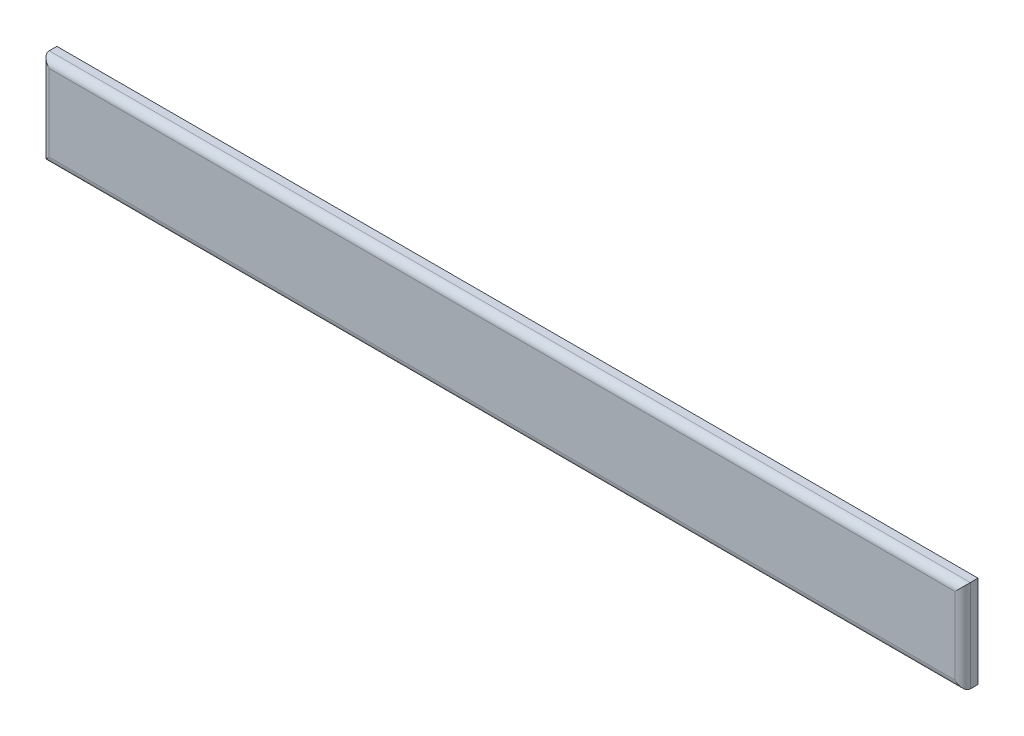
ISO-10303-21;
HEADER;
FILE_DESCRIPTION(('STEP AP214'),'2;1');
FILE_NAME('part.step','',(''),(''),'','','');
FILE_SCHEMA(('AUTOMOTIVE_DESIGN { 1 0 10303 214 1 1 1 1 }'));
ENDSEC;
DATA;
#1=APPLICATION_CONTEXT('core data for automotive mechanical design processes');
#2=APPLICATION_PROTOCOL_DEFINITION('international standard','automotive_design',2000,#1);
#3=PRODUCT_CONTEXT('',#1,'mechanical');
#4=PRODUCT('Part','Part','',(#3));
#5=PRODUCT_RELATED_PRODUCT_CATEGORY('part','',(#4));
#6=PRODUCT_DEFINITION_FORMATION('','',#4);
#7=PRODUCT_DEFINITION_CONTEXT('part definition',#1,'design');
#8=PRODUCT_DEFINITION('design','',#6,#7);
#9=PRODUCT_DEFINITION_SHAPE('','',#8);
#10=(LENGTH_UNIT() NAMED_UNIT(*) SI_UNIT(.MILLI.,.METRE.));
#11=(NAMED_UNIT(*) PLANE_ANGLE_UNIT() SI_UNIT($,.RADIAN.));
#12=(NAMED_UNIT(*) SI_UNIT($,.STERADIAN.) SOLID_ANGLE_UNIT());
#13=UNCERTAINTY_MEASURE_WITH_UNIT(LENGTH_MEASURE(1.E-05),#10,'distance_accuracy_value','');
#14=(GEOMETRIC_REPRESENTATION_CONTEXT(3) GLOBAL_UNCERTAINTY_ASSIGNED_CONTEXT((#13)) GLOBAL_UNIT_ASSIGNED_CONTEXT((#10,
#11,#12)) REPRESENTATION_CONTEXT('',''));
#15=CARTESIAN_POINT('',(0.,0.,0.));
#16=DIRECTION('',(0.,0.,1.));
#17=DIRECTION('',(1.,0.,0.));
#18=AXIS2_PLACEMENT_3D('',#15,#16,#17);
#19=CARTESIAN_POINT('',(3000.,-300.,-100.));
#20=DIRECTION('',(1.,0.,0.));
#21=DIRECTION('',(0.,0.,-1.));
#22=AXIS2_PLACEMENT_3D('',#19,#20,#21);
#23=PLANE('',#22);
#24=DIRECTION('',(0.,0.,1.));
#25=VECTOR('',#24,1.);
#26=CARTESIAN_POINT('',(3000.,300.,-100.));
#27=LINE('',#26,#25);
#28=CARTESIAN_POINT('',(3000.,300.,-100.));
#29=VERTEX_POINT('',#28);
#30=CARTESIAN_POINT('',(3000.,300.,-50.));
#31=VERTEX_POINT('',#30);
#32=EDGE_CURVE('E91',#29,#31,#27,.T.);
#33=ORIENTED_EDGE('',*,*,#32,.T.);
#34=DIRECTION('',(0.,1.,0.));
#35=VECTOR('',#34,1.);
#36=CARTESIAN_POINT('',(3000.,-300.,-50.));
#37=LINE('',#36,#35);
#38=CARTESIAN_POINT('',(3000.,-300.,-50.));
#39=VERTEX_POINT('',#38);
#40=EDGE_CURVE('E11',#31,#39,#37,.F.);
#41=ORIENTED_EDGE('',*,*,#40,.T.);
#42=DIRECTION('',(0.,0.,1.));
#43=VECTOR('',#42,1.);
#44=CARTESIAN_POINT('',(3000.,-300.,-100.));
#45=LINE('',#44,#43);
#46=CARTESIAN_POINT('',(3000.,-300.,-100.));
#47=VERTEX_POINT('',#46);
#48=EDGE_CURVE('E112',#47,#39,#45,.T.);
#49=ORIENTED_EDGE('',*,*,#48,.F.);
#50=DIRECTION('',(0.,1.,0.));
#51=VECTOR('',#50,1.);
#52=CARTESIAN_POINT('',(3000.,-300.,-100.));
#53=LINE('',#52,#51);
#54=EDGE_CURVE('E106',#47,#29,#53,.T.);
#55=ORIENTED_EDGE('',*,*,#54,.T.);
#56=EDGE_LOOP('',(#33,#41,#49,#55));
#57=FACE_BOUND('',#56,.T.);
#58=ADVANCED_FACE('F39',(#57),#23,.T.);
#59=CARTESIAN_POINT('',(-3000.,-300.,-100.));
#60=DIRECTION('',(0.,-1.,0.));
#61=DIRECTION('',(0.,0.,-1.));
#62=AXIS2_PLACEMENT_3D('',#59,#60,#61);
#63=PLANE('',#62);
#64=ORIENTED_EDGE('',*,*,#48,.T.);
#65=DIRECTION('',(1.,0.,0.));
#66=VECTOR('',#65,1.);
#67=CARTESIAN_POINT('',(-3000.,-300.,-50.));
#68=LINE('',#67,#66);
#69=CARTESIAN_POINT('',(-3000.,-300.,-50.));
#70=VERTEX_POINT('',#69);
#71=EDGE_CURVE('E132',#39,#70,#68,.F.);
#72=ORIENTED_EDGE('',*,*,#71,.T.);
#73=DIRECTION('',(0.,0.,1.));
#74=VECTOR('',#73,1.);
#75=CARTESIAN_POINT('',(-3000.,-300.,-100.));
#76=LINE('',#75,#74);
#77=CARTESIAN_POINT('',(-3000.,-300.,-100.));
#78=VERTEX_POINT('',#77);
#79=EDGE_CURVE('E121',#78,#70,#76,.T.);
#80=ORIENTED_EDGE('',*,*,#79,.F.);
#81=DIRECTION('',(1.,0.,0.));
#82=VECTOR('',#81,1.);
#83=CARTESIAN_POINT('',(-3000.,-300.,-100.));
#84=LINE('',#83,#82);
#85=EDGE_CURVE('E99',#78,#47,#84,.T.);
#86=ORIENTED_EDGE('',*,*,#85,.T.);
#87=EDGE_LOOP('',(#64,#72,#80,#86));
#88=FACE_BOUND('',#87,.T.);
#89=ADVANCED_FACE('F158',(#88),#63,.T.);
#90=CARTESIAN_POINT('',(-3000.,-300.,-100.));
#91=DIRECTION('',(-1.,0.,0.));
#92=DIRECTION('',(0.,0.,1.));
#93=AXIS2_PLACEMENT_3D('',#90,#91,#92);
#94=PLANE('',#93);
#95=ORIENTED_EDGE('',*,*,#79,.T.);
#96=DIRECTION('',(0.,-1.,0.));
#97=VECTOR('',#96,1.);
#98=CARTESIAN_POINT('',(-3000.,300.,-50.));
#99=LINE('',#98,#97);
#100=CARTESIAN_POINT('',(-3000.,300.,-50.));
#101=VERTEX_POINT('',#100);
#102=EDGE_CURVE('E63',#70,#101,#99,.F.);
#103=ORIENTED_EDGE('',*,*,#102,.T.);
#104=DIRECTION('',(0.,0.,1.));
#105=VECTOR('',#104,1.);
#106=CARTESIAN_POINT('',(-3000.,300.,-100.));
#107=LINE('',#106,#105);
#108=CARTESIAN_POINT('',(-3000.,300.,-100.));
#109=VERTEX_POINT('',#108);
#110=EDGE_CURVE('E98',#109,#101,#107,.T.);
#111=ORIENTED_EDGE('',*,*,#110,.F.);
#112=DIRECTION('',(0.,-1.,0.));
#113=VECTOR('',#112,1.);
#114=CARTESIAN_POINT('',(-3000.,-300.,-100.));
#115=LINE('',#114,#113);
#116=EDGE_CURVE('E109',#109,#78,#115,.T.);
#117=ORIENTED_EDGE('',*,*,#116,.T.);
#118=EDGE_LOOP('',(#95,#103,#111,#117));
#119=FACE_BOUND('',#118,.T.);
#120=ADVANCED_FACE('F159',(#119),#94,.T.);
#121=CARTESIAN_POINT('',(-3000.,300.,-100.));
#122=DIRECTION('',(0.,1.,0.));
#123=DIRECTION('',(0.,0.,1.));
#124=AXIS2_PLACEMENT_3D('',#121,#122,#123);
#125=PLANE('',#124);
#126=ORIENTED_EDGE('',*,*,#110,.T.);
#127=DIRECTION('',(-1.,0.,0.));
#128=VECTOR('',#127,1.);
#129=CARTESIAN_POINT('',(3000.,300.,-50.));
#130=LINE('',#129,#128);
#131=EDGE_CURVE('E48',#101,#31,#130,.F.);
#132=ORIENTED_EDGE('',*,*,#131,.T.);
#133=ORIENTED_EDGE('',*,*,#32,.F.);
#134=DIRECTION('',(-1.,0.,0.));
#135=VECTOR('',#134,1.);
#136=CARTESIAN_POINT('',(-3000.,300.,-100.));
#137=LINE('',#136,#135);
#138=EDGE_CURVE('E94',#29,#109,#137,.T.);
#139=ORIENTED_EDGE('',*,*,#138,.T.);
#140=EDGE_LOOP('',(#126,#132,#133,#139));
#141=FACE_BOUND('',#140,.T.);
#142=ADVANCED_FACE('F93',(#141),#125,.T.);
#143=CARTESIAN_POINT('',(0.,0.,-100.));
#144=DIRECTION('',(0.,0.,-1.));
#145=DIRECTION('',(-1.,0.,0.));
#146=AXIS2_PLACEMENT_3D('',#143,#144,#145);
#147=PLANE('',#146);
#148=ORIENTED_EDGE('',*,*,#54,.F.);
#149=ORIENTED_EDGE('',*,*,#85,.F.);
#150=ORIENTED_EDGE('',*,*,#116,.F.);
#151=ORIENTED_EDGE('',*,*,#138,.F.);
#152=EDGE_LOOP('',(#148,#149,#150,#151));
#153=FACE_BOUND('',#152,.T.);
#154=ADVANCED_FACE('F104',(#153),#147,.T.);
#155=CARTESIAN_POINT('',(0.,0.,0.));
#156=DIRECTION('',(0.,0.,-1.));
#157=DIRECTION('',(-1.,0.,0.));
#158=AXIS2_PLACEMENT_3D('',#155,#156,#157);
#159=PLANE('',#158);
#160=DIRECTION('',(0.,-1.,0.));
#161=VECTOR('',#160,1.);
#162=CARTESIAN_POINT('',(-2950.,-300.,0.));
#163=LINE('',#162,#161);
#164=CARTESIAN_POINT('',(-2950.,250.,0.));
#165=VERTEX_POINT('',#164);
#166=CARTESIAN_POINT('',(-2950.,-250.,0.));
#167=VERTEX_POINT('',#166);
#168=EDGE_CURVE('E127',#165,#167,#163,.T.);
#169=ORIENTED_EDGE('',*,*,#168,.T.);
#170=DIRECTION('',(1.,0.,0.));
#171=VECTOR('',#170,1.);
#172=CARTESIAN_POINT('',(3000.,-250.,0.));
#173=LINE('',#172,#171);
#174=CARTESIAN_POINT('',(2950.,-250.,0.));
#175=VERTEX_POINT('',#174);
#176=EDGE_CURVE('E129',#167,#175,#173,.T.);
#177=ORIENTED_EDGE('',*,*,#176,.T.);
#178=DIRECTION('',(0.,1.,0.));
#179=VECTOR('',#178,1.);
#180=CARTESIAN_POINT('',(2950.,300.,0.));
#181=LINE('',#180,#179);
#182=CARTESIAN_POINT('',(2950.,250.,0.));
#183=VERTEX_POINT('',#182);
#184=EDGE_CURVE('E120',#175,#183,#181,.T.);
#185=ORIENTED_EDGE('',*,*,#184,.T.);
#186=DIRECTION('',(-1.,0.,0.));
#187=VECTOR('',#186,1.);
#188=CARTESIAN_POINT('',(-3000.,250.,0.));
#189=LINE('',#188,#187);
#190=EDGE_CURVE('E125',#183,#165,#189,.T.);
#191=ORIENTED_EDGE('',*,*,#190,.T.);
#192=EDGE_LOOP('',(#169,#177,#185,#191));
#193=FACE_BOUND('',#192,.T.);
#194=ADVANCED_FACE('F151',(#193),#159,.F.);
#195=CARTESIAN_POINT('',(0.,250.,-50.));
#196=DIRECTION('',(1.,0.,0.));
#197=DIRECTION('',(0.,0.,-1.));
#198=AXIS2_PLACEMENT_3D('',#195,#196,#197);
#199=CYLINDRICAL_SURFACE('',#198,50.);
#200=CARTESIAN_POINT('',(2950.,250.,-50.));
#201=DIRECTION('',(0.707106781186547,-0.707106781186547,0.));
#202=DIRECTION('',(-0.707106781186547,-0.707106781186547,0.));
#203=AXIS2_PLACEMENT_3D('',#200,#201,#202);
#204=ELLIPSE('',#203,70.7106781186548,50.);
#205=EDGE_CURVE('E115',#31,#183,#204,.T.);
#206=ORIENTED_EDGE('',*,*,#205,.F.);
#207=ORIENTED_EDGE('',*,*,#131,.F.);
#208=CARTESIAN_POINT('',(-2950.,250.,-50.));
#209=DIRECTION('',(0.707106781186547,0.707106781186547,0.));
#210=DIRECTION('',(0.707106781186547,-0.707106781186547,0.));
#211=AXIS2_PLACEMENT_3D('',#208,#209,#210);
#212=ELLIPSE('',#211,70.7106781186548,50.);
#213=EDGE_CURVE('E43',#165,#101,#212,.F.);
#214=ORIENTED_EDGE('',*,*,#213,.F.);
#215=ORIENTED_EDGE('',*,*,#190,.F.);
#216=EDGE_LOOP('',(#206,#207,#214,#215));
#217=FACE_BOUND('',#216,.T.);
#218=ADVANCED_FACE('F41',(#217),#199,.T.);
#219=CARTESIAN_POINT('',(-2950.,0.,-50.));
#220=DIRECTION('',(0.,1.,0.));
#221=DIRECTION('',(0.,0.,1.));
#222=AXIS2_PLACEMENT_3D('',#219,#220,#221);
#223=CYLINDRICAL_SURFACE('',#222,50.);
#224=ORIENTED_EDGE('',*,*,#213,.T.);
#225=ORIENTED_EDGE('',*,*,#102,.F.);
#226=CARTESIAN_POINT('',(-2950.,-250.,-50.));
#227=DIRECTION('',(-0.707106781186547,0.707106781186547,0.));
#228=DIRECTION('',(0.707106781186547,0.707106781186547,0.));
#229=AXIS2_PLACEMENT_3D('',#226,#227,#228);
#230=ELLIPSE('',#229,70.7106781186548,50.);
#231=EDGE_CURVE('E139',#167,#70,#230,.F.);
#232=ORIENTED_EDGE('',*,*,#231,.F.);
#233=ORIENTED_EDGE('',*,*,#168,.F.);
#234=EDGE_LOOP('',(#224,#225,#232,#233));
#235=FACE_BOUND('',#234,.T.);
#236=ADVANCED_FACE('F176',(#235),#223,.T.);
#237=CARTESIAN_POINT('',(2950.,0.,-50.));
#238=DIRECTION('',(0.,-1.,0.));
#239=DIRECTION('',(0.,0.,-1.));
#240=AXIS2_PLACEMENT_3D('',#237,#238,#239);
#241=CYLINDRICAL_SURFACE('',#240,50.);
#242=ORIENTED_EDGE('',*,*,#205,.T.);
#243=ORIENTED_EDGE('',*,*,#184,.F.);
#244=CARTESIAN_POINT('',(2950.,-250.,-50.));
#245=DIRECTION('',(-0.707106781186547,-0.707106781186547,0.));
#246=DIRECTION('',(0.707106781186547,-0.707106781186547,0.));
#247=AXIS2_PLACEMENT_3D('',#244,#245,#246);
#248=ELLIPSE('',#247,70.7106781186548,50.);
#249=EDGE_CURVE('E137',#39,#175,#248,.T.);
#250=ORIENTED_EDGE('',*,*,#249,.F.);
#251=ORIENTED_EDGE('',*,*,#40,.F.);
#252=EDGE_LOOP('',(#242,#243,#250,#251));
#253=FACE_BOUND('',#252,.T.);
#254=ADVANCED_FACE('F144',(#253),#241,.T.);
#255=CARTESIAN_POINT('',(0.,-250.,-50.));
#256=DIRECTION('',(-1.,0.,0.));
#257=DIRECTION('',(0.,0.,1.));
#258=AXIS2_PLACEMENT_3D('',#255,#256,#257);
#259=CYLINDRICAL_SURFACE('',#258,50.);
#260=ORIENTED_EDGE('',*,*,#231,.T.);
#261=ORIENTED_EDGE('',*,*,#71,.F.);
#262=ORIENTED_EDGE('',*,*,#249,.T.);
#263=ORIENTED_EDGE('',*,*,#176,.F.);
#264=EDGE_LOOP('',(#260,#261,#262,#263));
#265=FACE_BOUND('',#264,.T.);
#266=ADVANCED_FACE('F155',(#265),#259,.T.);
#267=CLOSED_SHELL('',(#58,#89,#120,#142,#154,#194,#218,#236,#254,#266));
#268=MANIFOLD_SOLID_BREP('B2',#267);
#269=ADVANCED_BREP_SHAPE_REPRESENTATION('',(#18,#268),#14);
#270=SHAPE_DEFINITION_REPRESENTATION(#9,#269);
ENDSEC;
END-ISO-10303-21;
